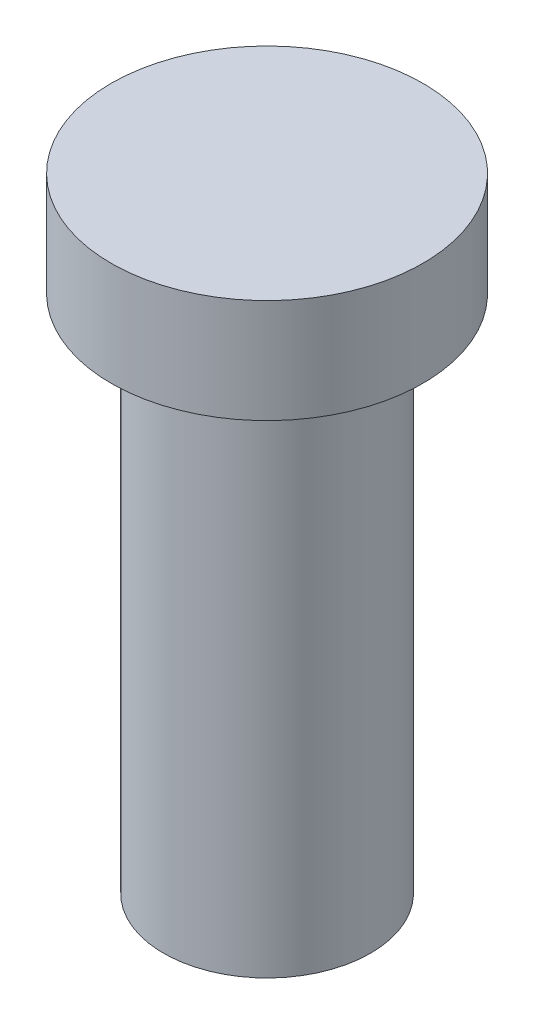
ISO-10303-21;
HEADER;
FILE_DESCRIPTION(('STEP AP214'),'2;1');
FILE_NAME('part.step','',(''),(''),'','','');
FILE_SCHEMA(('AUTOMOTIVE_DESIGN { 1 0 10303 214 1 1 1 1 }'));
ENDSEC;
DATA;
#1=APPLICATION_CONTEXT('core data for automotive mechanical design processes');
#2=APPLICATION_PROTOCOL_DEFINITION('international standard','automotive_design',2000,#1);
#3=PRODUCT_CONTEXT('',#1,'mechanical');
#4=PRODUCT('Part','Part','',(#3));
#5=PRODUCT_RELATED_PRODUCT_CATEGORY('part','',(#4));
#6=PRODUCT_DEFINITION_FORMATION('','',#4);
#7=PRODUCT_DEFINITION_CONTEXT('part definition',#1,'design');
#8=PRODUCT_DEFINITION('design','',#6,#7);
#9=PRODUCT_DEFINITION_SHAPE('','',#8);
#10=(LENGTH_UNIT() NAMED_UNIT(*) SI_UNIT(.MILLI.,.METRE.));
#11=(NAMED_UNIT(*) PLANE_ANGLE_UNIT() SI_UNIT($,.RADIAN.));
#12=(NAMED_UNIT(*) SI_UNIT($,.STERADIAN.) SOLID_ANGLE_UNIT());
#13=UNCERTAINTY_MEASURE_WITH_UNIT(LENGTH_MEASURE(1.E-05),#10,'distance_accuracy_value','');
#14=(GEOMETRIC_REPRESENTATION_CONTEXT(3) GLOBAL_UNCERTAINTY_ASSIGNED_CONTEXT((#13)) GLOBAL_UNIT_ASSIGNED_CONTEXT((#10,
#11,#12)) REPRESENTATION_CONTEXT('',''));
#15=CARTESIAN_POINT('',(0.,0.,0.));
#16=DIRECTION('',(0.,0.,1.));
#17=DIRECTION('',(1.,0.,0.));
#18=AXIS2_PLACEMENT_3D('',#15,#16,#17);
#19=CARTESIAN_POINT('',(0.,0.,0.));
#20=DIRECTION('',(0.,1.,0.));
#21=DIRECTION('',(-1.,0.,0.));
#22=AXIS2_PLACEMENT_3D('',#19,#20,#21);
#23=PLANE('',#22);
#24=CARTESIAN_POINT('',(0.,0.,0.));
#25=DIRECTION('',(0.,1.,0.));
#26=DIRECTION('',(-1.,0.,0.));
#27=AXIS2_PLACEMENT_3D('',#24,#25,#26);
#28=CIRCLE('',#27,6.3246);
#29=CARTESIAN_POINT('',(-6.3246,0.,0.));
#30=VERTEX_POINT('',#29);
#31=EDGE_CURVE('E10',#30,#30,#28,.T.);
#32=ORIENTED_EDGE('',*,*,#31,.F.);
#33=EDGE_LOOP('',(#32));
#34=FACE_BOUND('',#33,.T.);
#35=ADVANCED_FACE('F33',(#34),#23,.F.);
#36=CARTESIAN_POINT('',(0.,38.1,0.));
#37=DIRECTION('',(0.,1.,0.));
#38=DIRECTION('',(-1.,0.,0.));
#39=AXIS2_PLACEMENT_3D('',#36,#37,#38);
#40=CYLINDRICAL_SURFACE('',#39,6.3246);
#41=CARTESIAN_POINT('',(0.,31.75,0.));
#42=DIRECTION('',(0.,1.,0.));
#43=DIRECTION('',(-1.,0.,0.));
#44=AXIS2_PLACEMENT_3D('',#41,#42,#43);
#45=CIRCLE('',#44,6.3246);
#46=CARTESIAN_POINT('',(-6.3246,31.75,0.));
#47=VERTEX_POINT('',#46);
#48=EDGE_CURVE('E39',#47,#47,#45,.T.);
#49=ORIENTED_EDGE('',*,*,#48,.F.);
#50=EDGE_LOOP('',(#49));
#51=FACE_BOUND('',#50,.T.);
#52=ORIENTED_EDGE('',*,*,#31,.T.);
#53=EDGE_LOOP('',(#52));
#54=FACE_BOUND('',#53,.T.);
#55=ADVANCED_FACE('F63',(#51,#54),#40,.T.);
#56=CARTESIAN_POINT('',(6.3246,31.75,0.));
#57=DIRECTION('',(0.,1.,0.));
#58=DIRECTION('',(-1.,0.,0.));
#59=AXIS2_PLACEMENT_3D('',#56,#57,#58);
#60=PLANE('',#59);
#61=CARTESIAN_POINT('',(0.,31.75,0.));
#62=DIRECTION('',(0.,1.,0.));
#63=DIRECTION('',(-1.,0.,0.));
#64=AXIS2_PLACEMENT_3D('',#61,#62,#63);
#65=CIRCLE('',#64,9.525);
#66=CARTESIAN_POINT('',(-9.525,31.75,0.));
#67=VERTEX_POINT('',#66);
#68=EDGE_CURVE('E43',#67,#67,#65,.T.);
#69=ORIENTED_EDGE('',*,*,#68,.F.);
#70=EDGE_LOOP('',(#69));
#71=FACE_BOUND('',#70,.T.);
#72=ORIENTED_EDGE('',*,*,#48,.T.);
#73=EDGE_LOOP('',(#72));
#74=FACE_BOUND('',#73,.T.);
#75=ADVANCED_FACE('F58',(#71,#74),#60,.F.);
#76=CARTESIAN_POINT('',(0.,38.1,0.));
#77=DIRECTION('',(0.,1.,0.));
#78=DIRECTION('',(-1.,0.,0.));
#79=AXIS2_PLACEMENT_3D('',#76,#77,#78);
#80=CYLINDRICAL_SURFACE('',#79,9.525);
#81=CARTESIAN_POINT('',(0.,38.1,0.));
#82=DIRECTION('',(0.,1.,0.));
#83=DIRECTION('',(-1.,0.,0.));
#84=AXIS2_PLACEMENT_3D('',#81,#82,#83);
#85=CIRCLE('',#84,9.525);
#86=CARTESIAN_POINT('',(-9.525,38.1,0.));
#87=VERTEX_POINT('',#86);
#88=EDGE_CURVE('E47',#87,#87,#85,.T.);
#89=ORIENTED_EDGE('',*,*,#88,.F.);
#90=EDGE_LOOP('',(#89));
#91=FACE_BOUND('',#90,.T.);
#92=ORIENTED_EDGE('',*,*,#68,.T.);
#93=EDGE_LOOP('',(#92));
#94=FACE_BOUND('',#93,.T.);
#95=ADVANCED_FACE('F55',(#91,#94),#80,.T.);
#96=CARTESIAN_POINT('',(9.525,38.1,0.));
#97=DIRECTION('',(0.,-1.,0.));
#98=DIRECTION('',(1.,0.,0.));
#99=AXIS2_PLACEMENT_3D('',#96,#97,#98);
#100=PLANE('',#99);
#101=ORIENTED_EDGE('',*,*,#88,.T.);
#102=EDGE_LOOP('',(#101));
#103=FACE_BOUND('',#102,.T.);
#104=ADVANCED_FACE('F53',(#103),#100,.F.);
#105=CLOSED_SHELL('',(#35,#55,#75,#95,#104));
#106=MANIFOLD_SOLID_BREP('B2',#105);
#107=ADVANCED_BREP_SHAPE_REPRESENTATION('',(#18,#106),#14);
#108=SHAPE_DEFINITION_REPRESENTATION(#9,#107);
ENDSEC;
END-ISO-10303-21;
